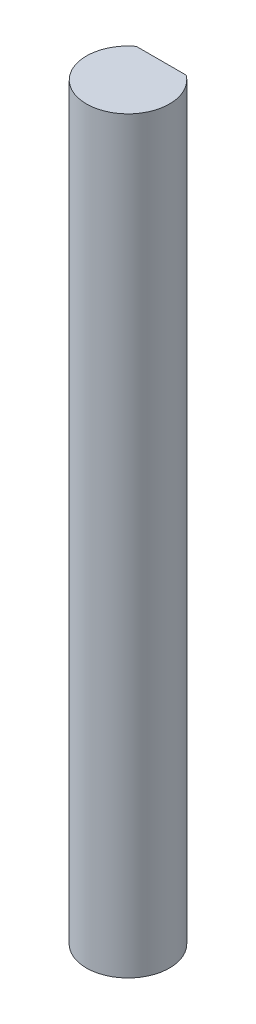
ISO-10303-21;
HEADER;
FILE_DESCRIPTION(('STEP AP214'),'2;1');
FILE_NAME('part.step','',(''),(''),'','','');
FILE_SCHEMA(('AUTOMOTIVE_DESIGN { 1 0 10303 214 1 1 1 1 }'));
ENDSEC;
DATA;
#1=APPLICATION_CONTEXT('core data for automotive mechanical design processes');
#2=APPLICATION_PROTOCOL_DEFINITION('international standard','automotive_design',2000,#1);
#3=PRODUCT_CONTEXT('',#1,'mechanical');
#4=PRODUCT('Part','Part','',(#3));
#5=PRODUCT_RELATED_PRODUCT_CATEGORY('part','',(#4));
#6=PRODUCT_DEFINITION_FORMATION('','',#4);
#7=PRODUCT_DEFINITION_CONTEXT('part definition',#1,'design');
#8=PRODUCT_DEFINITION('design','',#6,#7);
#9=PRODUCT_DEFINITION_SHAPE('','',#8);
#10=(LENGTH_UNIT() NAMED_UNIT(*) SI_UNIT(.MILLI.,.METRE.));
#11=(NAMED_UNIT(*) PLANE_ANGLE_UNIT() SI_UNIT($,.RADIAN.));
#12=(NAMED_UNIT(*) SI_UNIT($,.STERADIAN.) SOLID_ANGLE_UNIT());
#13=UNCERTAINTY_MEASURE_WITH_UNIT(LENGTH_MEASURE(1.E-05),#10,'distance_accuracy_value','');
#14=(GEOMETRIC_REPRESENTATION_CONTEXT(3) GLOBAL_UNCERTAINTY_ASSIGNED_CONTEXT((#13)) GLOBAL_UNIT_ASSIGNED_CONTEXT((#10,
#11,#12)) REPRESENTATION_CONTEXT('',''));
#15=CARTESIAN_POINT('',(0.,0.,0.));
#16=DIRECTION('',(0.,0.,1.));
#17=DIRECTION('',(1.,0.,0.));
#18=AXIS2_PLACEMENT_3D('',#15,#16,#17);
#19=CARTESIAN_POINT('',(0.,57.15,0.));
#20=DIRECTION('',(0.,-1.,0.));
#21=DIRECTION('',(0.,0.,-1.));
#22=AXIS2_PLACEMENT_3D('',#19,#20,#21);
#23=CYLINDRICAL_SURFACE('',#22,3.175);
#24=CARTESIAN_POINT('',(0.,0.,0.));
#25=DIRECTION('',(0.,1.,0.));
#26=DIRECTION('',(0.,0.,1.));
#27=AXIS2_PLACEMENT_3D('',#24,#25,#26);
#28=CIRCLE('',#27,3.175);
#29=CARTESIAN_POINT('',(-1.905,0.,-2.54));
#30=VERTEX_POINT('',#29);
#31=CARTESIAN_POINT('',(1.905,0.,-2.54));
#32=VERTEX_POINT('',#31);
#33=EDGE_CURVE('E64',#30,#32,#28,.T.);
#34=ORIENTED_EDGE('',*,*,#33,.T.);
#35=DIRECTION('',(0.,-1.,0.));
#36=VECTOR('',#35,1.);
#37=CARTESIAN_POINT('',(1.905,57.15,-2.54));
#38=LINE('',#37,#36);
#39=CARTESIAN_POINT('',(1.905,57.15,-2.54));
#40=VERTEX_POINT('',#39);
#41=EDGE_CURVE('E11',#40,#32,#38,.T.);
#42=ORIENTED_EDGE('',*,*,#41,.F.);
#43=CARTESIAN_POINT('',(0.,57.15,0.));
#44=DIRECTION('',(0.,1.,0.));
#45=DIRECTION('',(0.,0.,1.));
#46=AXIS2_PLACEMENT_3D('',#43,#44,#45);
#47=CIRCLE('',#46,3.175);
#48=CARTESIAN_POINT('',(-1.905,57.15,-2.54));
#49=VERTEX_POINT('',#48);
#50=EDGE_CURVE('E63',#49,#40,#47,.T.);
#51=ORIENTED_EDGE('',*,*,#50,.F.);
#52=DIRECTION('',(0.,-1.,0.));
#53=VECTOR('',#52,1.);
#54=CARTESIAN_POINT('',(-1.905,57.15,-2.54));
#55=LINE('',#54,#53);
#56=EDGE_CURVE('E41',#49,#30,#55,.T.);
#57=ORIENTED_EDGE('',*,*,#56,.T.);
#58=EDGE_LOOP('',(#34,#42,#51,#57));
#59=FACE_BOUND('',#58,.T.);
#60=ADVANCED_FACE('F33',(#59),#23,.T.);
#61=CARTESIAN_POINT('',(-1.905,57.15,-2.54));
#62=DIRECTION('',(0.,0.,1.));
#63=DIRECTION('',(1.,0.,0.));
#64=AXIS2_PLACEMENT_3D('',#61,#62,#63);
#65=PLANE('',#64);
#66=DIRECTION('',(-1.,0.,0.));
#67=VECTOR('',#66,1.);
#68=CARTESIAN_POINT('',(-1.905,0.,-2.54));
#69=LINE('',#68,#67);
#70=EDGE_CURVE('E56',#32,#30,#69,.T.);
#71=ORIENTED_EDGE('',*,*,#70,.T.);
#72=ORIENTED_EDGE('',*,*,#56,.F.);
#73=DIRECTION('',(-1.,0.,0.));
#74=VECTOR('',#73,1.);
#75=CARTESIAN_POINT('',(-1.905,57.15,-2.54));
#76=LINE('',#75,#74);
#77=EDGE_CURVE('E48',#40,#49,#76,.T.);
#78=ORIENTED_EDGE('',*,*,#77,.F.);
#79=ORIENTED_EDGE('',*,*,#41,.T.);
#80=EDGE_LOOP('',(#71,#72,#78,#79));
#81=FACE_BOUND('',#80,.T.);
#82=ADVANCED_FACE('F59',(#81),#65,.F.);
#83=CARTESIAN_POINT('',(0.,57.15,0.));
#84=DIRECTION('',(0.,1.,0.));
#85=DIRECTION('',(0.,0.,1.));
#86=AXIS2_PLACEMENT_3D('',#83,#84,#85);
#87=PLANE('',#86);
#88=ORIENTED_EDGE('',*,*,#50,.T.);
#89=ORIENTED_EDGE('',*,*,#77,.T.);
#90=EDGE_LOOP('',(#88,#89));
#91=FACE_BOUND('',#90,.T.);
#92=ADVANCED_FACE('F71',(#91),#87,.T.);
#93=CARTESIAN_POINT('',(0.,0.,0.));
#94=DIRECTION('',(0.,1.,0.));
#95=DIRECTION('',(0.,0.,1.));
#96=AXIS2_PLACEMENT_3D('',#93,#94,#95);
#97=PLANE('',#96);
#98=ORIENTED_EDGE('',*,*,#33,.F.);
#99=ORIENTED_EDGE('',*,*,#70,.F.);
#100=EDGE_LOOP('',(#98,#99));
#101=FACE_BOUND('',#100,.T.);
#102=ADVANCED_FACE('F67',(#101),#97,.F.);
#103=CLOSED_SHELL('',(#60,#82,#92,#102));
#104=MANIFOLD_SOLID_BREP('B2',#103);
#105=ADVANCED_BREP_SHAPE_REPRESENTATION('',(#18,#104),#14);
#106=SHAPE_DEFINITION_REPRESENTATION(#9,#105);
ENDSEC;
END-ISO-10303-21;
